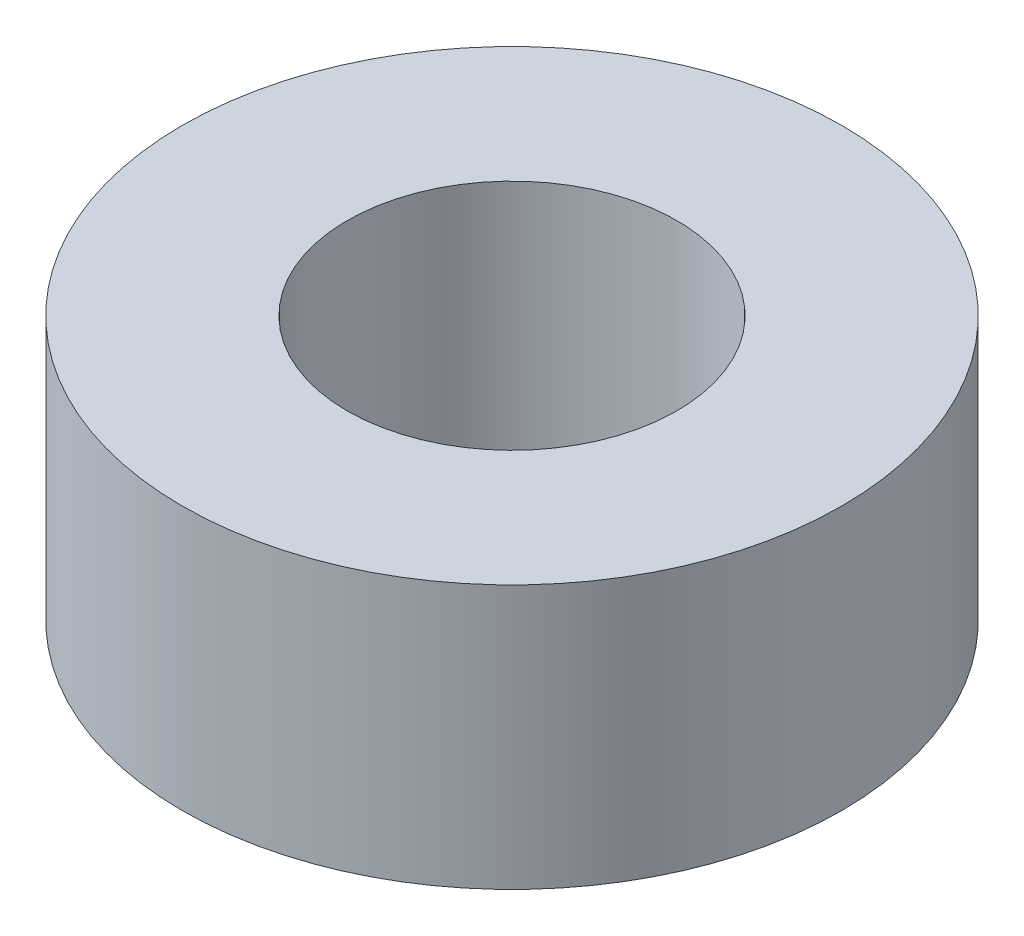
ISO-10303-21;
HEADER;
FILE_DESCRIPTION(('STEP AP214'),'2;1');
FILE_NAME('part.step','',(''),(''),'','','');
FILE_SCHEMA(('AUTOMOTIVE_DESIGN { 1 0 10303 214 1 1 1 1 }'));
ENDSEC;
DATA;
#1=APPLICATION_CONTEXT('core data for automotive mechanical design processes');
#2=APPLICATION_PROTOCOL_DEFINITION('international standard','automotive_design',2000,#1);
#3=PRODUCT_CONTEXT('',#1,'mechanical');
#4=PRODUCT('Part','Part','',(#3));
#5=PRODUCT_RELATED_PRODUCT_CATEGORY('part','',(#4));
#6=PRODUCT_DEFINITION_FORMATION('','',#4);
#7=PRODUCT_DEFINITION_CONTEXT('part definition',#1,'design');
#8=PRODUCT_DEFINITION('design','',#6,#7);
#9=PRODUCT_DEFINITION_SHAPE('','',#8);
#10=(LENGTH_UNIT() NAMED_UNIT(*) SI_UNIT(.MILLI.,.METRE.));
#11=(NAMED_UNIT(*) PLANE_ANGLE_UNIT() SI_UNIT($,.RADIAN.));
#12=(NAMED_UNIT(*) SI_UNIT($,.STERADIAN.) SOLID_ANGLE_UNIT());
#13=UNCERTAINTY_MEASURE_WITH_UNIT(LENGTH_MEASURE(1.E-05),#10,'distance_accuracy_value','');
#14=(GEOMETRIC_REPRESENTATION_CONTEXT(3) GLOBAL_UNCERTAINTY_ASSIGNED_CONTEXT((#13)) GLOBAL_UNIT_ASSIGNED_CONTEXT((#10,
#11,#12)) REPRESENTATION_CONTEXT('',''));
#15=CARTESIAN_POINT('',(0.,0.,0.));
#16=DIRECTION('',(0.,0.,1.));
#17=DIRECTION('',(1.,0.,0.));
#18=AXIS2_PLACEMENT_3D('',#15,#16,#17);
#19=CARTESIAN_POINT('',(0.,24.,0.));
#20=DIRECTION('',(0.,-1.,0.));
#21=DIRECTION('',(0.,0.,-1.));
#22=AXIS2_PLACEMENT_3D('',#19,#20,#21);
#23=CYLINDRICAL_SURFACE('',#22,30.);
#24=CARTESIAN_POINT('',(0.,24.,0.));
#25=DIRECTION('',(0.,1.,0.));
#26=DIRECTION('',(0.,0.,1.));
#27=AXIS2_PLACEMENT_3D('',#24,#25,#26);
#28=CIRCLE('',#27,30.);
#29=CARTESIAN_POINT('',(0.,24.,30.));
#30=VERTEX_POINT('',#29);
#31=EDGE_CURVE('E10',#30,#30,#28,.T.);
#32=ORIENTED_EDGE('',*,*,#31,.F.);
#33=EDGE_LOOP('',(#32));
#34=FACE_BOUND('',#33,.T.);
#35=CARTESIAN_POINT('',(0.,0.,0.));
#36=DIRECTION('',(0.,1.,0.));
#37=DIRECTION('',(0.,0.,1.));
#38=AXIS2_PLACEMENT_3D('',#35,#36,#37);
#39=CIRCLE('',#38,30.);
#40=CARTESIAN_POINT('',(0.,0.,30.));
#41=VERTEX_POINT('',#40);
#42=EDGE_CURVE('E37',#41,#41,#39,.T.);
#43=ORIENTED_EDGE('',*,*,#42,.T.);
#44=EDGE_LOOP('',(#43));
#45=FACE_BOUND('',#44,.T.);
#46=ADVANCED_FACE('F40',(#34,#45),#23,.T.);
#47=CARTESIAN_POINT('',(0.,24.,0.));
#48=DIRECTION('',(0.,1.,0.));
#49=DIRECTION('',(0.,0.,1.));
#50=AXIS2_PLACEMENT_3D('',#47,#48,#49);
#51=PLANE('',#50);
#52=CARTESIAN_POINT('',(0.,24.,0.));
#53=DIRECTION('',(0.,1.,0.));
#54=DIRECTION('',(0.,0.,1.));
#55=AXIS2_PLACEMENT_3D('',#52,#53,#54);
#56=CIRCLE('',#55,15.);
#57=CARTESIAN_POINT('',(0.,24.,15.));
#58=VERTEX_POINT('',#57);
#59=EDGE_CURVE('E50',#58,#58,#56,.T.);
#60=ORIENTED_EDGE('',*,*,#59,.F.);
#61=EDGE_LOOP('',(#60));
#62=FACE_BOUND('',#61,.T.);
#63=ORIENTED_EDGE('',*,*,#31,.T.);
#64=EDGE_LOOP('',(#63));
#65=FACE_BOUND('',#64,.T.);
#66=ADVANCED_FACE('F59',(#62,#65),#51,.T.);
#67=CARTESIAN_POINT('',(0.,0.,0.));
#68=DIRECTION('',(0.,1.,0.));
#69=DIRECTION('',(0.,0.,1.));
#70=AXIS2_PLACEMENT_3D('',#67,#68,#69);
#71=PLANE('',#70);
#72=CARTESIAN_POINT('',(0.,0.,0.));
#73=DIRECTION('',(0.,1.,0.));
#74=DIRECTION('',(0.,0.,1.));
#75=AXIS2_PLACEMENT_3D('',#72,#73,#74);
#76=CIRCLE('',#75,15.);
#77=CARTESIAN_POINT('',(0.,0.,15.));
#78=VERTEX_POINT('',#77);
#79=EDGE_CURVE('E47',#78,#78,#76,.T.);
#80=ORIENTED_EDGE('',*,*,#79,.T.);
#81=EDGE_LOOP('',(#80));
#82=FACE_BOUND('',#81,.T.);
#83=ORIENTED_EDGE('',*,*,#42,.F.);
#84=EDGE_LOOP('',(#83));
#85=FACE_BOUND('',#84,.T.);
#86=ADVANCED_FACE('F58',(#82,#85),#71,.F.);
#87=CARTESIAN_POINT('',(0.,24.,0.));
#88=DIRECTION('',(0.,-1.,0.));
#89=DIRECTION('',(0.,0.,-1.));
#90=AXIS2_PLACEMENT_3D('',#87,#88,#89);
#91=CYLINDRICAL_SURFACE('',#90,15.);
#92=ORIENTED_EDGE('',*,*,#59,.T.);
#93=EDGE_LOOP('',(#92));
#94=FACE_BOUND('',#93,.T.);
#95=ORIENTED_EDGE('',*,*,#79,.F.);
#96=EDGE_LOOP('',(#95));
#97=FACE_BOUND('',#96,.T.);
#98=ADVANCED_FACE('F54',(#94,#97),#91,.F.);
#99=CLOSED_SHELL('',(#46,#66,#86,#98));
#100=MANIFOLD_SOLID_BREP('B2',#99);
#101=ADVANCED_BREP_SHAPE_REPRESENTATION('',(#18,#100),#14);
#102=SHAPE_DEFINITION_REPRESENTATION(#9,#101);
ENDSEC;
END-ISO-10303-21;
